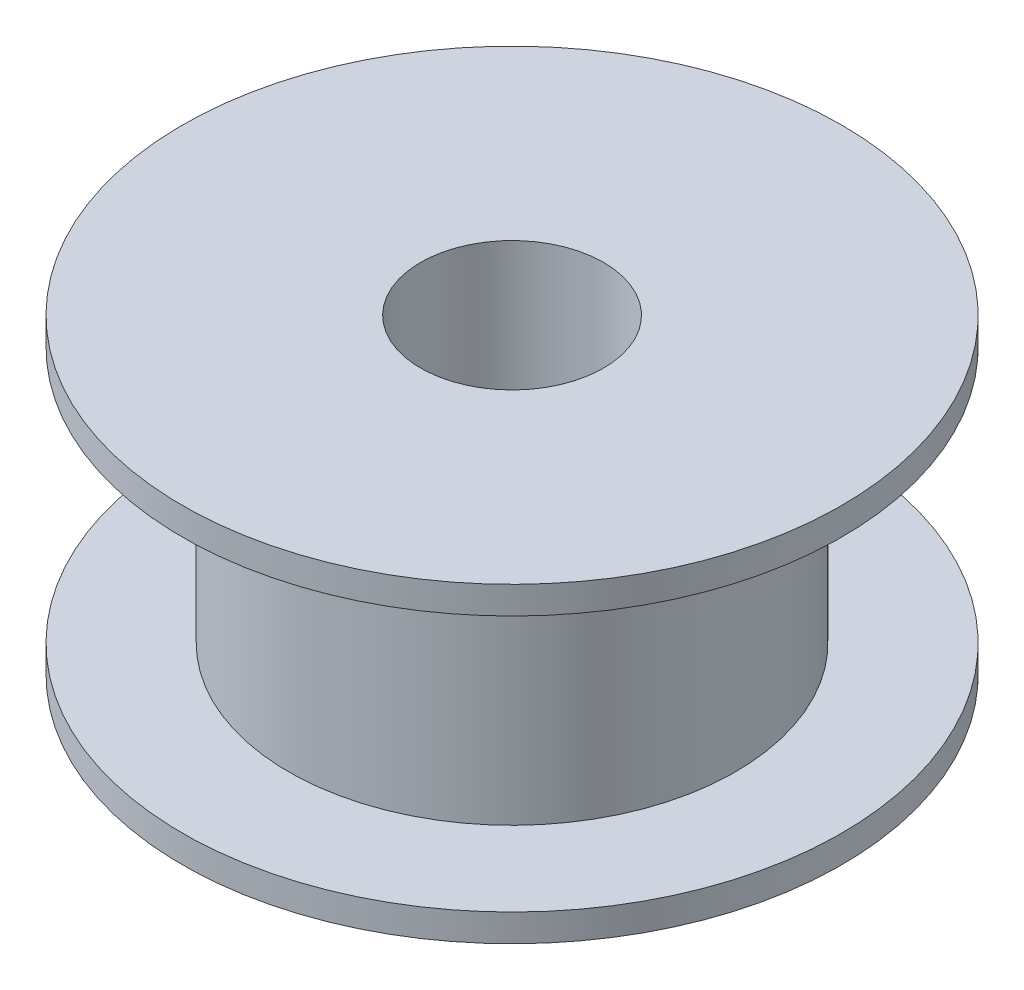
ISO-10303-21;
HEADER;
FILE_DESCRIPTION(('STEP AP214'),'2;1');
FILE_NAME('part.step','',(''),(''),'','','');
FILE_SCHEMA(('AUTOMOTIVE_DESIGN { 1 0 10303 214 1 1 1 1 }'));
ENDSEC;
DATA;
#1=APPLICATION_CONTEXT('core data for automotive mechanical design processes');
#2=APPLICATION_PROTOCOL_DEFINITION('international standard','automotive_design',2000,#1);
#3=PRODUCT_CONTEXT('',#1,'mechanical');
#4=PRODUCT('Part','Part','',(#3));
#5=PRODUCT_RELATED_PRODUCT_CATEGORY('part','',(#4));
#6=PRODUCT_DEFINITION_FORMATION('','',#4);
#7=PRODUCT_DEFINITION_CONTEXT('part definition',#1,'design');
#8=PRODUCT_DEFINITION('design','',#6,#7);
#9=PRODUCT_DEFINITION_SHAPE('','',#8);
#10=(LENGTH_UNIT() NAMED_UNIT(*) SI_UNIT(.MILLI.,.METRE.));
#11=(NAMED_UNIT(*) PLANE_ANGLE_UNIT() SI_UNIT($,.RADIAN.));
#12=(NAMED_UNIT(*) SI_UNIT($,.STERADIAN.) SOLID_ANGLE_UNIT());
#13=UNCERTAINTY_MEASURE_WITH_UNIT(LENGTH_MEASURE(1.E-05),#10,'distance_accuracy_value','');
#14=(GEOMETRIC_REPRESENTATION_CONTEXT(3) GLOBAL_UNCERTAINTY_ASSIGNED_CONTEXT((#13)) GLOBAL_UNIT_ASSIGNED_CONTEXT((#10,
#11,#12)) REPRESENTATION_CONTEXT('',''));
#15=CARTESIAN_POINT('',(0.,0.,0.));
#16=DIRECTION('',(0.,0.,1.));
#17=DIRECTION('',(1.,0.,0.));
#18=AXIS2_PLACEMENT_3D('',#15,#16,#17);
#19=CARTESIAN_POINT('',(9.,0.,0.));
#20=DIRECTION('',(0.,-1.,0.));
#21=DIRECTION('',(0.,0.,-1.));
#22=AXIS2_PLACEMENT_3D('',#19,#20,#21);
#23=PLANE('',#22);
#24=CARTESIAN_POINT('',(0.,0.,0.));
#25=DIRECTION('',(0.,-1.,0.));
#26=DIRECTION('',(0.,0.,-1.));
#27=AXIS2_PLACEMENT_3D('',#24,#25,#26);
#28=CIRCLE('',#27,9.);
#29=CARTESIAN_POINT('',(0.,0.,-9.));
#30=VERTEX_POINT('',#29);
#31=EDGE_CURVE('E59',#30,#30,#28,.T.);
#32=ORIENTED_EDGE('',*,*,#31,.T.);
#33=EDGE_LOOP('',(#32));
#34=FACE_BOUND('',#33,.T.);
#35=CARTESIAN_POINT('',(0.,0.,0.));
#36=DIRECTION('',(0.,-1.,0.));
#37=DIRECTION('',(0.,0.,-1.));
#38=AXIS2_PLACEMENT_3D('',#35,#36,#37);
#39=CIRCLE('',#38,2.5);
#40=CARTESIAN_POINT('',(0.,0.,-2.5));
#41=VERTEX_POINT('',#40);
#42=EDGE_CURVE('E10',#41,#41,#39,.T.);
#43=ORIENTED_EDGE('',*,*,#42,.F.);
#44=EDGE_LOOP('',(#43));
#45=FACE_BOUND('',#44,.T.);
#46=ADVANCED_FACE('F31',(#34,#45),#23,.T.);
#47=CARTESIAN_POINT('',(0.,0.,0.));
#48=DIRECTION('',(0.,-1.,0.));
#49=DIRECTION('',(0.,0.,-1.));
#50=AXIS2_PLACEMENT_3D('',#47,#48,#49);
#51=CYLINDRICAL_SURFACE('',#50,2.5);
#52=ORIENTED_EDGE('',*,*,#42,.T.);
#53=EDGE_LOOP('',(#52));
#54=FACE_BOUND('',#53,.T.);
#55=CARTESIAN_POINT('',(0.,8.5,0.));
#56=DIRECTION('',(0.,-1.,0.));
#57=DIRECTION('',(0.,0.,-1.));
#58=AXIS2_PLACEMENT_3D('',#55,#56,#57);
#59=CIRCLE('',#58,2.5);
#60=CARTESIAN_POINT('',(0.,8.5,-2.5));
#61=VERTEX_POINT('',#60);
#62=EDGE_CURVE('E37',#61,#61,#59,.T.);
#63=ORIENTED_EDGE('',*,*,#62,.F.);
#64=EDGE_LOOP('',(#63));
#65=FACE_BOUND('',#64,.T.);
#66=ADVANCED_FACE('F77',(#54,#65),#51,.F.);
#67=CARTESIAN_POINT('',(2.5,8.5,0.));
#68=DIRECTION('',(0.,1.,0.));
#69=DIRECTION('',(0.,0.,1.));
#70=AXIS2_PLACEMENT_3D('',#67,#68,#69);
#71=PLANE('',#70);
#72=ORIENTED_EDGE('',*,*,#62,.T.);
#73=EDGE_LOOP('',(#72));
#74=FACE_BOUND('',#73,.T.);
#75=CARTESIAN_POINT('',(0.,8.5,0.));
#76=DIRECTION('',(0.,-1.,0.));
#77=DIRECTION('',(0.,0.,-1.));
#78=AXIS2_PLACEMENT_3D('',#75,#76,#77);
#79=CIRCLE('',#78,9.);
#80=CARTESIAN_POINT('',(0.,8.5,-9.));
#81=VERTEX_POINT('',#80);
#82=EDGE_CURVE('E41',#81,#81,#79,.T.);
#83=ORIENTED_EDGE('',*,*,#82,.F.);
#84=EDGE_LOOP('',(#83));
#85=FACE_BOUND('',#84,.T.);
#86=ADVANCED_FACE('F81',(#74,#85),#71,.T.);
#87=CARTESIAN_POINT('',(0.,0.,0.));
#88=DIRECTION('',(0.,-1.,0.));
#89=DIRECTION('',(0.,0.,-1.));
#90=AXIS2_PLACEMENT_3D('',#87,#88,#89);
#91=CYLINDRICAL_SURFACE('',#90,9.);
#92=ORIENTED_EDGE('',*,*,#82,.T.);
#93=EDGE_LOOP('',(#92));
#94=FACE_BOUND('',#93,.T.);
#95=CARTESIAN_POINT('',(0.,7.75,0.));
#96=DIRECTION('',(0.,-1.,0.));
#97=DIRECTION('',(0.,0.,-1.));
#98=AXIS2_PLACEMENT_3D('',#95,#96,#97);
#99=CIRCLE('',#98,9.);
#100=CARTESIAN_POINT('',(0.,7.75,-9.));
#101=VERTEX_POINT('',#100);
#102=EDGE_CURVE('E45',#101,#101,#99,.T.);
#103=ORIENTED_EDGE('',*,*,#102,.F.);
#104=EDGE_LOOP('',(#103));
#105=FACE_BOUND('',#104,.T.);
#106=ADVANCED_FACE('F85',(#94,#105),#91,.T.);
#107=CARTESIAN_POINT('',(9.,7.75,0.));
#108=DIRECTION('',(0.,-1.,0.));
#109=DIRECTION('',(0.,0.,-1.));
#110=AXIS2_PLACEMENT_3D('',#107,#108,#109);
#111=PLANE('',#110);
#112=ORIENTED_EDGE('',*,*,#102,.T.);
#113=EDGE_LOOP('',(#112));
#114=FACE_BOUND('',#113,.T.);
#115=CARTESIAN_POINT('',(0.,7.75,0.));
#116=DIRECTION('',(0.,-1.,0.));
#117=DIRECTION('',(0.,0.,-1.));
#118=AXIS2_PLACEMENT_3D('',#115,#116,#117);
#119=CIRCLE('',#118,6.1);
#120=CARTESIAN_POINT('',(0.,7.75,-6.1));
#121=VERTEX_POINT('',#120);
#122=EDGE_CURVE('E50',#121,#121,#119,.T.);
#123=ORIENTED_EDGE('',*,*,#122,.F.);
#124=EDGE_LOOP('',(#123));
#125=FACE_BOUND('',#124,.T.);
#126=ADVANCED_FACE('F91',(#114,#125),#111,.T.);
#127=CARTESIAN_POINT('',(0.,0.,0.));
#128=DIRECTION('',(0.,-1.,0.));
#129=DIRECTION('',(0.,0.,-1.));
#130=AXIS2_PLACEMENT_3D('',#127,#128,#129);
#131=CYLINDRICAL_SURFACE('',#130,6.1);
#132=ORIENTED_EDGE('',*,*,#122,.T.);
#133=EDGE_LOOP('',(#132));
#134=FACE_BOUND('',#133,.T.);
#135=CARTESIAN_POINT('',(0.,0.75,0.));
#136=DIRECTION('',(0.,-1.,0.));
#137=DIRECTION('',(0.,0.,-1.));
#138=AXIS2_PLACEMENT_3D('',#135,#136,#137);
#139=CIRCLE('',#138,6.1);
#140=CARTESIAN_POINT('',(0.,0.75,-6.1));
#141=VERTEX_POINT('',#140);
#142=EDGE_CURVE('E53',#141,#141,#139,.T.);
#143=ORIENTED_EDGE('',*,*,#142,.F.);
#144=EDGE_LOOP('',(#143));
#145=FACE_BOUND('',#144,.T.);
#146=ADVANCED_FACE('F73',(#134,#145),#131,.T.);
#147=CARTESIAN_POINT('',(6.1,0.75,0.));
#148=DIRECTION('',(0.,1.,0.));
#149=DIRECTION('',(0.,0.,1.));
#150=AXIS2_PLACEMENT_3D('',#147,#148,#149);
#151=PLANE('',#150);
#152=ORIENTED_EDGE('',*,*,#142,.T.);
#153=EDGE_LOOP('',(#152));
#154=FACE_BOUND('',#153,.T.);
#155=CARTESIAN_POINT('',(0.,0.75,0.));
#156=DIRECTION('',(0.,-1.,0.));
#157=DIRECTION('',(0.,0.,-1.));
#158=AXIS2_PLACEMENT_3D('',#155,#156,#157);
#159=CIRCLE('',#158,9.);
#160=CARTESIAN_POINT('',(0.,0.75,-9.));
#161=VERTEX_POINT('',#160);
#162=EDGE_CURVE('E56',#161,#161,#159,.T.);
#163=ORIENTED_EDGE('',*,*,#162,.F.);
#164=EDGE_LOOP('',(#163));
#165=FACE_BOUND('',#164,.T.);
#166=ADVANCED_FACE('F67',(#154,#165),#151,.T.);
#167=CARTESIAN_POINT('',(0.,0.,0.));
#168=DIRECTION('',(0.,-1.,0.));
#169=DIRECTION('',(0.,0.,-1.));
#170=AXIS2_PLACEMENT_3D('',#167,#168,#169);
#171=CYLINDRICAL_SURFACE('',#170,9.);
#172=ORIENTED_EDGE('',*,*,#162,.T.);
#173=EDGE_LOOP('',(#172));
#174=FACE_BOUND('',#173,.T.);
#175=ORIENTED_EDGE('',*,*,#31,.F.);
#176=EDGE_LOOP('',(#175));
#177=FACE_BOUND('',#176,.T.);
#178=ADVANCED_FACE('F65',(#174,#177),#171,.T.);
#179=CLOSED_SHELL('',(#46,#66,#86,#106,#126,#146,#166,#178));
#180=MANIFOLD_SOLID_BREP('B2',#179);
#181=ADVANCED_BREP_SHAPE_REPRESENTATION('',(#18,#180),#14);
#182=SHAPE_DEFINITION_REPRESENTATION(#9,#181);
ENDSEC;
END-ISO-10303-21;
